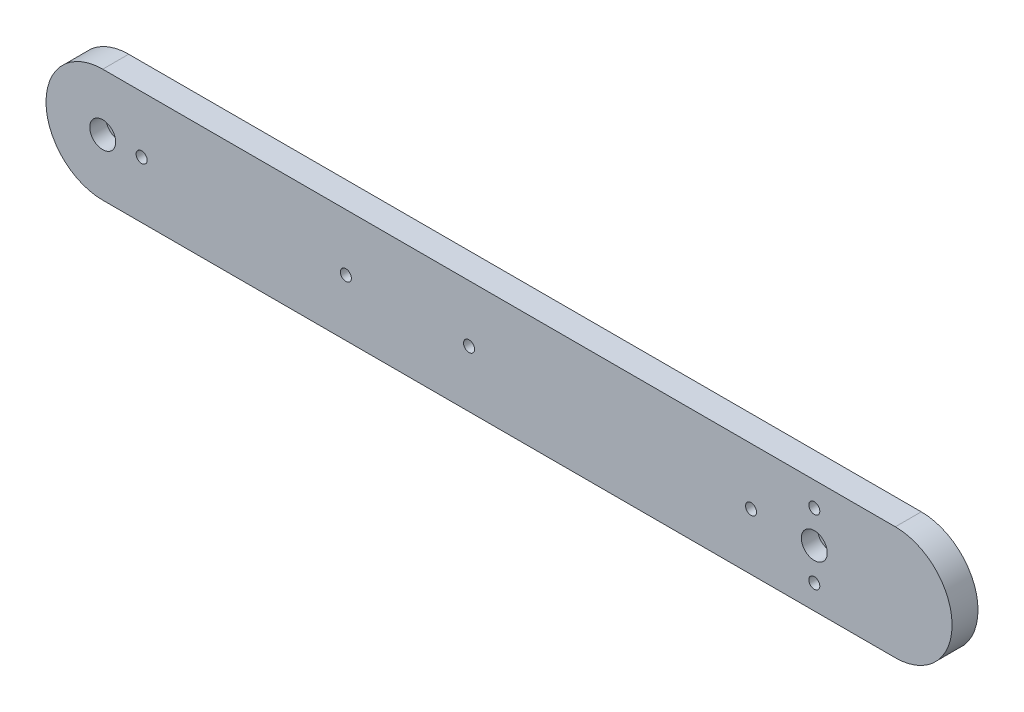
ISO-10303-21;
HEADER;
FILE_DESCRIPTION(('STEP AP214'),'2;1');
FILE_NAME('part.step','',(''),(''),'','','');
FILE_SCHEMA(('AUTOMOTIVE_DESIGN { 1 0 10303 214 1 1 1 1 }'));
ENDSEC;
DATA;
#1=APPLICATION_CONTEXT('core data for automotive mechanical design processes');
#2=APPLICATION_PROTOCOL_DEFINITION('international standard','automotive_design',2000,#1);
#3=PRODUCT_CONTEXT('',#1,'mechanical');
#4=PRODUCT('Part','Part','',(#3));
#5=PRODUCT_RELATED_PRODUCT_CATEGORY('part','',(#4));
#6=PRODUCT_DEFINITION_FORMATION('','',#4);
#7=PRODUCT_DEFINITION_CONTEXT('part definition',#1,'design');
#8=PRODUCT_DEFINITION('design','',#6,#7);
#9=PRODUCT_DEFINITION_SHAPE('','',#8);
#10=(LENGTH_UNIT() NAMED_UNIT(*) SI_UNIT(.MILLI.,.METRE.));
#11=(NAMED_UNIT(*) PLANE_ANGLE_UNIT() SI_UNIT($,.RADIAN.));
#12=(NAMED_UNIT(*) SI_UNIT($,.STERADIAN.) SOLID_ANGLE_UNIT());
#13=UNCERTAINTY_MEASURE_WITH_UNIT(LENGTH_MEASURE(1.E-05),#10,'distance_accuracy_value','');
#14=(GEOMETRIC_REPRESENTATION_CONTEXT(3) GLOBAL_UNCERTAINTY_ASSIGNED_CONTEXT((#13)) GLOBAL_UNIT_ASSIGNED_CONTEXT((#10,
#11,#12)) REPRESENTATION_CONTEXT('',''));
#15=CARTESIAN_POINT('',(0.,0.,0.));
#16=DIRECTION('',(0.,0.,1.));
#17=DIRECTION('',(1.,0.,0.));
#18=AXIS2_PLACEMENT_3D('',#15,#16,#17);
#19=CARTESIAN_POINT('',(0.,35.,4.00000005960464));
#20=DIRECTION('',(0.,1.,0.));
#21=DIRECTION('',(1.,0.,0.));
#22=AXIS2_PLACEMENT_3D('',#19,#20,#21);
#23=PLANE('',#22);
#24=DIRECTION('',(0.,0.,1.));
#25=VECTOR('',#24,1.);
#26=CARTESIAN_POINT('',(-109.750003814697,35.,0.));
#27=LINE('',#26,#25);
#28=CARTESIAN_POINT('',(-109.750003814697,35.,0.));
#29=VERTEX_POINT('',#28);
#30=CARTESIAN_POINT('',(-109.750003814697,35.,8.00000011920929));
#31=VERTEX_POINT('',#30);
#32=EDGE_CURVE('E54',#29,#31,#27,.T.);
#33=ORIENTED_EDGE('',*,*,#32,.T.);
#34=DIRECTION('',(1.,0.,0.));
#35=VECTOR('',#34,1.);
#36=CARTESIAN_POINT('',(-6.89071037865788E-09,35.,8.00000011920929));
#37=LINE('',#36,#35);
#38=CARTESIAN_POINT('',(134.750003814697,35.,8.00000011920929));
#39=VERTEX_POINT('',#38);
#40=EDGE_CURVE('E136',#31,#39,#37,.T.);
#41=ORIENTED_EDGE('',*,*,#40,.T.);
#42=DIRECTION('',(0.,0.,-1.));
#43=VECTOR('',#42,1.);
#44=CARTESIAN_POINT('',(134.750003814697,35.,63.0567889830724));
#45=LINE('',#44,#43);
#46=CARTESIAN_POINT('',(134.750003814697,35.,0.));
#47=VERTEX_POINT('',#46);
#48=EDGE_CURVE('E240',#39,#47,#45,.T.);
#49=ORIENTED_EDGE('',*,*,#48,.T.);
#50=DIRECTION('',(-1.,0.,0.));
#51=VECTOR('',#50,1.);
#52=CARTESIAN_POINT('',(-6.62273830837674E-08,35.,0.));
#53=LINE('',#52,#51);
#54=EDGE_CURVE('E60',#47,#29,#53,.T.);
#55=ORIENTED_EDGE('',*,*,#54,.T.);
#56=EDGE_LOOP('',(#33,#41,#49,#55));
#57=FACE_BOUND('',#56,.T.);
#58=ADVANCED_FACE('F50',(#57),#23,.T.);
#59=CARTESIAN_POINT('',(0.,0.,4.00000005960464));
#60=DIRECTION('',(0.,1.,0.));
#61=DIRECTION('',(1.,0.,0.));
#62=AXIS2_PLACEMENT_3D('',#59,#60,#61);
#63=PLANE('',#62);
#64=DIRECTION('',(1.,0.,0.));
#65=VECTOR('',#64,1.);
#66=CARTESIAN_POINT('',(-6.62273830837674E-08,0.,0.));
#67=LINE('',#66,#65);
#68=CARTESIAN_POINT('',(-109.750003814697,0.,0.));
#69=VERTEX_POINT('',#68);
#70=CARTESIAN_POINT('',(134.750003814697,0.,0.));
#71=VERTEX_POINT('',#70);
#72=EDGE_CURVE('E11',#69,#71,#67,.T.);
#73=ORIENTED_EDGE('',*,*,#72,.T.);
#74=DIRECTION('',(0.,0.,-1.));
#75=VECTOR('',#74,1.);
#76=CARTESIAN_POINT('',(134.750003814697,0.,63.0567889830724));
#77=LINE('',#76,#75);
#78=CARTESIAN_POINT('',(134.750003814697,0.,8.00000011920929));
#79=VERTEX_POINT('',#78);
#80=EDGE_CURVE('E231',#79,#71,#77,.T.);
#81=ORIENTED_EDGE('',*,*,#80,.F.);
#82=DIRECTION('',(-1.,0.,0.));
#83=VECTOR('',#82,1.);
#84=CARTESIAN_POINT('',(-6.89071037865788E-09,0.,8.00000011920929));
#85=LINE('',#84,#83);
#86=CARTESIAN_POINT('',(-109.750003814697,0.,8.00000011920929));
#87=VERTEX_POINT('',#86);
#88=EDGE_CURVE('E156',#79,#87,#85,.T.);
#89=ORIENTED_EDGE('',*,*,#88,.T.);
#90=DIRECTION('',(0.,0.,-1.));
#91=VECTOR('',#90,1.);
#92=CARTESIAN_POINT('',(-109.750003814697,0.,0.));
#93=LINE('',#92,#91);
#94=EDGE_CURVE('E140',#87,#69,#93,.T.);
#95=ORIENTED_EDGE('',*,*,#94,.T.);
#96=EDGE_LOOP('',(#73,#81,#89,#95));
#97=FACE_BOUND('',#96,.T.);
#98=ADVANCED_FACE('F232',(#97),#63,.F.);
#99=CARTESIAN_POINT('',(-1.32454766167535E-07,17.5000002266865,0.));
#100=DIRECTION('',(0.,0.,1.));
#101=DIRECTION('',(1.,0.,0.));
#102=AXIS2_PLACEMENT_3D('',#99,#100,#101);
#103=PLANE('',#102);
#104=CARTESIAN_POINT('',(109.750001212742,27.5000003452395,0.));
#105=DIRECTION('',(0.,0.,-1.));
#106=DIRECTION('',(-1.,0.,0.));
#107=AXIS2_PLACEMENT_3D('',#104,#105,#106);
#108=CIRCLE('',#107,4.00000000000001);
#109=CARTESIAN_POINT('',(105.750001212742,27.5000003452395,0.));
#110=VERTEX_POINT('',#109);
#111=EDGE_CURVE('E296',#110,#110,#108,.T.);
#112=ORIENTED_EDGE('',*,*,#111,.F.);
#113=EDGE_LOOP('',(#112));
#114=FACE_BOUND('',#113,.T.);
#115=CARTESIAN_POINT('',(109.750001212742,7.5000003452395,0.));
#116=DIRECTION('',(0.,0.,-1.));
#117=DIRECTION('',(1.,0.,0.));
#118=AXIS2_PLACEMENT_3D('',#115,#116,#117);
#119=CIRCLE('',#118,4.00000000000001);
#120=CARTESIAN_POINT('',(113.750001212742,7.5000003452395,0.));
#121=VERTEX_POINT('',#120);
#122=EDGE_CURVE('E301',#121,#121,#119,.T.);
#123=ORIENTED_EDGE('',*,*,#122,.F.);
#124=EDGE_LOOP('',(#123));
#125=FACE_BOUND('',#124,.T.);
#126=CARTESIAN_POINT('',(90.2499984818617,17.5,0.));
#127=DIRECTION('',(0.,0.,-1.));
#128=DIRECTION('',(-1.,0.,0.));
#129=AXIS2_PLACEMENT_3D('',#126,#127,#128);
#130=CIRCLE('',#129,4.00000000000001);
#131=CARTESIAN_POINT('',(86.2499984818617,17.5,0.));
#132=VERTEX_POINT('',#131);
#133=EDGE_CURVE('E262',#132,#132,#130,.T.);
#134=ORIENTED_EDGE('',*,*,#133,.F.);
#135=EDGE_LOOP('',(#134));
#136=FACE_BOUND('',#135,.T.);
#137=CARTESIAN_POINT('',(3.24999848186169,17.5,0.));
#138=DIRECTION('',(0.,0.,-1.));
#139=DIRECTION('',(-1.,0.,0.));
#140=AXIS2_PLACEMENT_3D('',#137,#138,#139);
#141=CIRCLE('',#140,4.);
#142=CARTESIAN_POINT('',(-0.750001518138306,17.5,0.));
#143=VERTEX_POINT('',#142);
#144=EDGE_CURVE('E265',#143,#143,#141,.T.);
#145=ORIENTED_EDGE('',*,*,#144,.F.);
#146=EDGE_LOOP('',(#145));
#147=FACE_BOUND('',#146,.T.);
#148=CARTESIAN_POINT('',(109.750001212742,17.5000003452395,0.));
#149=DIRECTION('',(0.,0.,1.));
#150=DIRECTION('',(-1.,0.,0.));
#151=AXIS2_PLACEMENT_3D('',#148,#149,#150);
#152=CIRCLE('',#151,1.70000088262025);
#153=CARTESIAN_POINT('',(111.450002095363,17.5000003452395,0.));
#154=VERTEX_POINT('',#153);
#155=EDGE_CURVE('E155',#154,#154,#152,.T.);
#156=ORIENTED_EDGE('',*,*,#155,.T.);
#157=EDGE_LOOP('',(#156));
#158=FACE_BOUND('',#157,.T.);
#159=CARTESIAN_POINT('',(-109.750002847488,17.5000003452395,-1.37445610448594E-12));
#160=DIRECTION('',(0.,0.,1.));
#161=DIRECTION('',(-1.,0.,0.));
#162=AXIS2_PLACEMENT_3D('',#159,#160,#161);
#163=CIRCLE('',#162,1.69999945421585);
#164=CARTESIAN_POINT('',(-108.050003393272,17.5000003452395,-1.35391697853038E-12));
#165=VERTEX_POINT('',#164);
#166=EDGE_CURVE('E159',#165,#165,#163,.T.);
#167=ORIENTED_EDGE('',*,*,#166,.T.);
#168=EDGE_LOOP('',(#167));
#169=FACE_BOUND('',#168,.T.);
#170=CARTESIAN_POINT('',(-34.7500015181383,17.5,0.));
#171=DIRECTION('',(0.,0.,1.));
#172=DIRECTION('',(1.,0.,0.));
#173=AXIS2_PLACEMENT_3D('',#170,#171,#172);
#174=CIRCLE('',#173,4.);
#175=CARTESIAN_POINT('',(-38.7500015181383,17.5,0.));
#176=VERTEX_POINT('',#175);
#177=EDGE_CURVE('E130',#176,#176,#174,.T.);
#178=ORIENTED_EDGE('',*,*,#177,.T.);
#179=EDGE_LOOP('',(#178));
#180=FACE_BOUND('',#179,.T.);
#181=CARTESIAN_POINT('',(-97.7500015181383,17.5,0.));
#182=DIRECTION('',(0.,0.,1.));
#183=DIRECTION('',(1.,0.,0.));
#184=AXIS2_PLACEMENT_3D('',#181,#182,#183);
#185=CIRCLE('',#184,4.);
#186=CARTESIAN_POINT('',(-101.750001518138,17.5,0.));
#187=VERTEX_POINT('',#186);
#188=EDGE_CURVE('E145',#187,#187,#185,.T.);
#189=ORIENTED_EDGE('',*,*,#188,.T.);
#190=EDGE_LOOP('',(#189));
#191=FACE_BOUND('',#190,.T.);
#192=ORIENTED_EDGE('',*,*,#54,.F.);
#193=CARTESIAN_POINT('',(134.750003814697,17.5,0.));
#194=DIRECTION('',(0.,0.,-1.));
#195=DIRECTION('',(-1.,0.,0.));
#196=AXIS2_PLACEMENT_3D('',#193,#194,#195);
#197=CIRCLE('',#196,17.5);
#198=EDGE_CURVE('E242',#47,#71,#197,.T.);
#199=ORIENTED_EDGE('',*,*,#198,.T.);
#200=ORIENTED_EDGE('',*,*,#72,.F.);
#201=CARTESIAN_POINT('',(-109.750003814697,17.5,0.));
#202=DIRECTION('',(0.,0.,-1.));
#203=DIRECTION('',(0.,1.,0.));
#204=AXIS2_PLACEMENT_3D('',#201,#202,#203);
#205=CIRCLE('',#204,17.5);
#206=EDGE_CURVE('E158',#69,#29,#205,.T.);
#207=ORIENTED_EDGE('',*,*,#206,.T.);
#208=EDGE_LOOP('',(#192,#199,#200,#207));
#209=FACE_BOUND('',#208,.T.);
#210=ADVANCED_FACE('F210',(#114,#125,#136,#147,#158,#169,#180,#191,#209),#103,.F.);
#211=CARTESIAN_POINT('',(-1.37814207573158E-08,17.5000002363904,8.00000011920929));
#212=DIRECTION('',(0.,0.,1.));
#213=DIRECTION('',(1.,0.,0.));
#214=AXIS2_PLACEMENT_3D('',#211,#212,#213);
#215=PLANE('',#214);
#216=CARTESIAN_POINT('',(109.750001212742,27.5000003452395,8.00000011920929));
#217=DIRECTION('',(0.,0.,-1.));
#218=DIRECTION('',(-1.,0.,0.));
#219=AXIS2_PLACEMENT_3D('',#216,#217,#218);
#220=CIRCLE('',#219,1.7);
#221=CARTESIAN_POINT('',(108.050001212742,27.5000003452395,8.00000011920929));
#222=VERTEX_POINT('',#221);
#223=EDGE_CURVE('E317',#222,#222,#220,.T.);
#224=ORIENTED_EDGE('',*,*,#223,.T.);
#225=EDGE_LOOP('',(#224));
#226=FACE_BOUND('',#225,.T.);
#227=CARTESIAN_POINT('',(109.750001212742,7.5000003452395,8.00000011920929));
#228=DIRECTION('',(0.,0.,-1.));
#229=DIRECTION('',(-1.,0.,0.));
#230=AXIS2_PLACEMENT_3D('',#227,#228,#229);
#231=CIRCLE('',#230,1.7);
#232=CARTESIAN_POINT('',(108.050001212742,7.5000003452395,8.00000011920929));
#233=VERTEX_POINT('',#232);
#234=EDGE_CURVE('E321',#233,#233,#231,.T.);
#235=ORIENTED_EDGE('',*,*,#234,.T.);
#236=EDGE_LOOP('',(#235));
#237=FACE_BOUND('',#236,.T.);
#238=CARTESIAN_POINT('',(90.2499984818617,17.5,8.00000011920929));
#239=DIRECTION('',(0.,0.,-1.));
#240=DIRECTION('',(-1.,0.,0.));
#241=AXIS2_PLACEMENT_3D('',#238,#239,#240);
#242=CIRCLE('',#241,1.7);
#243=CARTESIAN_POINT('',(88.5499984818617,17.5,8.00000011920929));
#244=VERTEX_POINT('',#243);
#245=EDGE_CURVE('E247',#244,#244,#242,.T.);
#246=ORIENTED_EDGE('',*,*,#245,.T.);
#247=EDGE_LOOP('',(#246));
#248=FACE_BOUND('',#247,.T.);
#249=CARTESIAN_POINT('',(3.24999848186169,17.5,8.00000011920929));
#250=DIRECTION('',(0.,0.,-1.));
#251=DIRECTION('',(-1.,0.,0.));
#252=AXIS2_PLACEMENT_3D('',#249,#250,#251);
#253=CIRCLE('',#252,1.7);
#254=CARTESIAN_POINT('',(1.54999848186169,17.5,8.00000011920929));
#255=VERTEX_POINT('',#254);
#256=EDGE_CURVE('E237',#255,#255,#253,.T.);
#257=ORIENTED_EDGE('',*,*,#256,.T.);
#258=EDGE_LOOP('',(#257));
#259=FACE_BOUND('',#258,.T.);
#260=CARTESIAN_POINT('',(109.750001685195,17.5000003453171,8.00000011920922));
#261=DIRECTION('',(0.,0.,-1.));
#262=DIRECTION('',(1.,0.,0.));
#263=AXIS2_PLACEMENT_3D('',#260,#261,#262);
#264=CIRCLE('',#263,3.99999970796028);
#265=CARTESIAN_POINT('',(105.750001977235,17.5000003453171,8.00000011920923));
#266=VERTEX_POINT('',#265);
#267=EDGE_CURVE('E120',#266,#266,#264,.T.);
#268=ORIENTED_EDGE('',*,*,#267,.T.);
#269=EDGE_LOOP('',(#268));
#270=FACE_BOUND('',#269,.T.);
#271=CARTESIAN_POINT('',(-109.750001518138,17.500000345317,8.00000011920903));
#272=DIRECTION('',(0.,0.,-1.));
#273=DIRECTION('',(1.,0.,0.));
#274=AXIS2_PLACEMENT_3D('',#271,#272,#273);
#275=CIRCLE('',#274,4.00000049849267);
#276=CARTESIAN_POINT('',(-113.750002016631,17.500000345317,8.00000011920904));
#277=VERTEX_POINT('',#276);
#278=EDGE_CURVE('E146',#277,#277,#275,.T.);
#279=ORIENTED_EDGE('',*,*,#278,.T.);
#280=EDGE_LOOP('',(#279));
#281=FACE_BOUND('',#280,.T.);
#282=CARTESIAN_POINT('',(-34.7500015181383,17.5,8.00000011920929));
#283=DIRECTION('',(0.,0.,-1.));
#284=DIRECTION('',(-1.,0.,0.));
#285=AXIS2_PLACEMENT_3D('',#282,#283,#284);
#286=CIRCLE('',#285,1.7);
#287=CARTESIAN_POINT('',(-33.0500015181383,17.5,8.00000011920929));
#288=VERTEX_POINT('',#287);
#289=EDGE_CURVE('E119',#288,#288,#286,.T.);
#290=ORIENTED_EDGE('',*,*,#289,.T.);
#291=EDGE_LOOP('',(#290));
#292=FACE_BOUND('',#291,.T.);
#293=CARTESIAN_POINT('',(-97.7500015181383,17.5,8.00000011920929));
#294=DIRECTION('',(0.,0.,-1.));
#295=DIRECTION('',(-1.,0.,0.));
#296=AXIS2_PLACEMENT_3D('',#293,#294,#295);
#297=CIRCLE('',#296,1.7);
#298=CARTESIAN_POINT('',(-96.0500015181383,17.5,8.00000011920929));
#299=VERTEX_POINT('',#298);
#300=EDGE_CURVE('E175',#299,#299,#297,.T.);
#301=ORIENTED_EDGE('',*,*,#300,.T.);
#302=EDGE_LOOP('',(#301));
#303=FACE_BOUND('',#302,.T.);
#304=ORIENTED_EDGE('',*,*,#88,.F.);
#305=CARTESIAN_POINT('',(134.750003814697,17.5,8.00000011920929));
#306=DIRECTION('',(0.,0.,1.));
#307=DIRECTION('',(1.,0.,0.));
#308=AXIS2_PLACEMENT_3D('',#305,#306,#307);
#309=CIRCLE('',#308,17.5);
#310=EDGE_CURVE('E224',#39,#79,#309,.F.);
#311=ORIENTED_EDGE('',*,*,#310,.F.);
#312=ORIENTED_EDGE('',*,*,#40,.F.);
#313=CARTESIAN_POINT('',(-109.750003814697,17.5,8.0000001192093));
#314=DIRECTION('',(0.,0.,1.));
#315=DIRECTION('',(0.,1.,0.));
#316=AXIS2_PLACEMENT_3D('',#313,#314,#315);
#317=CIRCLE('',#316,17.5);
#318=EDGE_CURVE('E137',#31,#87,#317,.T.);
#319=ORIENTED_EDGE('',*,*,#318,.T.);
#320=EDGE_LOOP('',(#304,#311,#312,#319));
#321=FACE_BOUND('',#320,.T.);
#322=ADVANCED_FACE('F206',(#226,#237,#248,#259,#270,#281,#292,#303,#321),#215,.T.);
#323=CARTESIAN_POINT('',(-109.750002347506,17.5000003094857,3.00000011920929));
#324=DIRECTION('',(0.,0.,1.));
#325=DIRECTION('',(1.,0.,0.));
#326=AXIS2_PLACEMENT_3D('',#323,#324,#325);
#327=PLANE('',#326);
#328=CARTESIAN_POINT('',(-109.750002847488,17.5000003452395,3.00000011920929));
#329=DIRECTION('',(0.,0.,-1.));
#330=DIRECTION('',(-1.,0.,0.));
#331=AXIS2_PLACEMENT_3D('',#328,#329,#330);
#332=CIRCLE('',#331,1.69999945421585);
#333=CARTESIAN_POINT('',(-108.050003393272,17.5000003452395,3.00000011920931));
#334=VERTEX_POINT('',#333);
#335=EDGE_CURVE('E170',#334,#334,#332,.T.);
#336=ORIENTED_EDGE('',*,*,#335,.T.);
#337=EDGE_LOOP('',(#336));
#338=FACE_BOUND('',#337,.T.);
#339=CARTESIAN_POINT('',(-109.750001518138,17.500000345317,3.00000011920929));
#340=DIRECTION('',(0.,0.,1.));
#341=DIRECTION('',(1.,0.,0.));
#342=AXIS2_PLACEMENT_3D('',#339,#340,#341);
#343=CIRCLE('',#342,4.00000049849267);
#344=CARTESIAN_POINT('',(-113.750002016631,17.500000345317,3.00000011920927));
#345=VERTEX_POINT('',#344);
#346=EDGE_CURVE('E153',#345,#345,#343,.T.);
#347=ORIENTED_EDGE('',*,*,#346,.T.);
#348=EDGE_LOOP('',(#347));
#349=FACE_BOUND('',#348,.T.);
#350=ADVANCED_FACE('F209',(#338,#349),#327,.T.);
#351=CARTESIAN_POINT('',(109.750001430511,17.5000003094857,3.00000011920929));
#352=DIRECTION('',(0.,0.,1.));
#353=DIRECTION('',(1.,0.,0.));
#354=AXIS2_PLACEMENT_3D('',#351,#352,#353);
#355=PLANE('',#354);
#356=CARTESIAN_POINT('',(109.750001212742,17.5000003452395,3.00000011920929));
#357=DIRECTION('',(0.,0.,-1.));
#358=DIRECTION('',(-1.,0.,0.));
#359=AXIS2_PLACEMENT_3D('',#356,#357,#358);
#360=CIRCLE('',#359,1.70000088262025);
#361=CARTESIAN_POINT('',(111.450002095363,17.5000003452395,3.00000011920929));
#362=VERTEX_POINT('',#361);
#363=EDGE_CURVE('E163',#362,#362,#360,.T.);
#364=ORIENTED_EDGE('',*,*,#363,.T.);
#365=EDGE_LOOP('',(#364));
#366=FACE_BOUND('',#365,.T.);
#367=CARTESIAN_POINT('',(109.750001685195,17.5000003453171,3.00000011920929));
#368=DIRECTION('',(0.,0.,1.));
#369=DIRECTION('',(1.,0.,0.));
#370=AXIS2_PLACEMENT_3D('',#367,#368,#369);
#371=CIRCLE('',#370,3.99999970796028);
#372=CARTESIAN_POINT('',(105.750001977235,17.5000003453171,3.00000011920929));
#373=VERTEX_POINT('',#372);
#374=EDGE_CURVE('E150',#373,#373,#371,.T.);
#375=ORIENTED_EDGE('',*,*,#374,.T.);
#376=EDGE_LOOP('',(#375));
#377=FACE_BOUND('',#376,.T.);
#378=ADVANCED_FACE('F52',(#366,#377),#355,.T.);
#379=CARTESIAN_POINT('',(-109.750003814697,17.5,0.));
#380=DIRECTION('',(0.,0.,-1.));
#381=DIRECTION('',(0.,1.,0.));
#382=AXIS2_PLACEMENT_3D('',#379,#380,#381);
#383=CYLINDRICAL_SURFACE('',#382,17.5);
#384=ORIENTED_EDGE('',*,*,#94,.F.);
#385=ORIENTED_EDGE('',*,*,#318,.F.);
#386=ORIENTED_EDGE('',*,*,#32,.F.);
#387=ORIENTED_EDGE('',*,*,#206,.F.);
#388=EDGE_LOOP('',(#384,#385,#386,#387));
#389=FACE_BOUND('',#388,.T.);
#390=ADVANCED_FACE('F361',(#389),#383,.T.);
#391=CARTESIAN_POINT('',(-109.750002847488,17.5000003452395,3.00000011920929));
#392=DIRECTION('',(0.,0.,1.));
#393=DIRECTION('',(-1.,0.,0.));
#394=AXIS2_PLACEMENT_3D('',#391,#392,#393);
#395=CYLINDRICAL_SURFACE('',#394,1.69999945421585);
#396=ORIENTED_EDGE('',*,*,#166,.F.);
#397=DIRECTION('',(0.,0.,1.));
#398=VECTOR('',#397,1.);
#399=CARTESIAN_POINT('',(-108.050003393272,17.5000003452395,3.00000011920931));
#400=LINE('',#399,#398);
#401=EDGE_CURVE('E162',#165,#334,#400,.T.);
#402=ORIENTED_EDGE('',*,*,#401,.T.);
#403=ORIENTED_EDGE('',*,*,#335,.F.);
#404=ORIENTED_EDGE('',*,*,#401,.F.);
#405=EDGE_LOOP('',(#396,#402,#403,#404));
#406=FACE_BOUND('',#405,.T.);
#407=ADVANCED_FACE('F364',(#406),#395,.F.);
#408=CARTESIAN_POINT('',(109.750001212742,17.5000003452395,3.00000011920929));
#409=DIRECTION('',(0.,0.,1.));
#410=DIRECTION('',(-1.,0.,0.));
#411=AXIS2_PLACEMENT_3D('',#408,#409,#410);
#412=CYLINDRICAL_SURFACE('',#411,1.70000088262025);
#413=ORIENTED_EDGE('',*,*,#155,.F.);
#414=DIRECTION('',(0.,0.,1.));
#415=VECTOR('',#414,1.);
#416=CARTESIAN_POINT('',(111.450002095363,17.5000003452395,3.00000011920929));
#417=LINE('',#416,#415);
#418=EDGE_CURVE('E173',#154,#362,#417,.T.);
#419=ORIENTED_EDGE('',*,*,#418,.T.);
#420=ORIENTED_EDGE('',*,*,#363,.F.);
#421=ORIENTED_EDGE('',*,*,#418,.F.);
#422=EDGE_LOOP('',(#413,#419,#420,#421));
#423=FACE_BOUND('',#422,.T.);
#424=ADVANCED_FACE('F368',(#423),#412,.F.);
#425=CARTESIAN_POINT('',(-109.750001518138,17.500000345317,8.00000011920929));
#426=DIRECTION('',(0.,0.,-1.));
#427=DIRECTION('',(1.,0.,0.));
#428=AXIS2_PLACEMENT_3D('',#425,#426,#427);
#429=CYLINDRICAL_SURFACE('',#428,4.00000049849267);
#430=ORIENTED_EDGE('',*,*,#278,.F.);
#431=DIRECTION('',(0.,0.,-1.));
#432=VECTOR('',#431,1.);
#433=CARTESIAN_POINT('',(-113.750002016631,17.500000345317,8.00000011920928));
#434=LINE('',#433,#432);
#435=EDGE_CURVE('E149',#277,#345,#434,.T.);
#436=ORIENTED_EDGE('',*,*,#435,.T.);
#437=ORIENTED_EDGE('',*,*,#346,.F.);
#438=ORIENTED_EDGE('',*,*,#435,.F.);
#439=EDGE_LOOP('',(#430,#436,#437,#438));
#440=FACE_BOUND('',#439,.T.);
#441=ADVANCED_FACE('F350',(#440),#429,.F.);
#442=CARTESIAN_POINT('',(109.750001685195,17.5000003453171,8.00000011920929));
#443=DIRECTION('',(0.,0.,-1.));
#444=DIRECTION('',(1.,0.,0.));
#445=AXIS2_PLACEMENT_3D('',#442,#443,#444);
#446=CYLINDRICAL_SURFACE('',#445,3.99999970796028);
#447=ORIENTED_EDGE('',*,*,#267,.F.);
#448=DIRECTION('',(0.,0.,-1.));
#449=VECTOR('',#448,1.);
#450=CARTESIAN_POINT('',(105.750001977235,17.5000003453171,8.00000011920929));
#451=LINE('',#450,#449);
#452=EDGE_CURVE('E123',#266,#373,#451,.T.);
#453=ORIENTED_EDGE('',*,*,#452,.T.);
#454=ORIENTED_EDGE('',*,*,#374,.F.);
#455=ORIENTED_EDGE('',*,*,#452,.F.);
#456=EDGE_LOOP('',(#447,#453,#454,#455));
#457=FACE_BOUND('',#456,.T.);
#458=ADVANCED_FACE('F204',(#457),#446,.F.);
#459=CARTESIAN_POINT('',(-34.7500015181383,17.5,8.00000011920929));
#460=DIRECTION('',(0.,0.,-1.));
#461=DIRECTION('',(-1.,0.,0.));
#462=AXIS2_PLACEMENT_3D('',#459,#460,#461);
#463=CYLINDRICAL_SURFACE('',#462,1.7);
#464=ORIENTED_EDGE('',*,*,#289,.F.);
#465=DIRECTION('',(0.,0.,-1.));
#466=VECTOR('',#465,1.);
#467=CARTESIAN_POINT('',(-33.0500015181383,17.5,8.00000011920929));
#468=LINE('',#467,#466);
#469=CARTESIAN_POINT('',(-33.0500015181383,17.5,4.));
#470=VERTEX_POINT('',#469);
#471=EDGE_CURVE('E114',#288,#470,#468,.T.);
#472=ORIENTED_EDGE('',*,*,#471,.T.);
#473=CARTESIAN_POINT('',(-34.7500015181383,17.5,4.));
#474=DIRECTION('',(0.,0.,-1.));
#475=DIRECTION('',(-1.,0.,0.));
#476=AXIS2_PLACEMENT_3D('',#473,#474,#475);
#477=CIRCLE('',#476,1.7);
#478=EDGE_CURVE('E117',#470,#470,#477,.T.);
#479=ORIENTED_EDGE('',*,*,#478,.T.);
#480=ORIENTED_EDGE('',*,*,#471,.F.);
#481=EDGE_LOOP('',(#464,#472,#479,#480));
#482=FACE_BOUND('',#481,.T.);
#483=ADVANCED_FACE('F115',(#482),#463,.F.);
#484=CARTESIAN_POINT('',(-97.7500015181383,17.5,8.00000011920929));
#485=DIRECTION('',(0.,0.,-1.));
#486=DIRECTION('',(-1.,0.,0.));
#487=AXIS2_PLACEMENT_3D('',#484,#485,#486);
#488=CYLINDRICAL_SURFACE('',#487,1.7);
#489=ORIENTED_EDGE('',*,*,#300,.F.);
#490=DIRECTION('',(0.,0.,-1.));
#491=VECTOR('',#490,1.);
#492=CARTESIAN_POINT('',(-96.0500015181383,17.5,8.00000011920929));
#493=LINE('',#492,#491);
#494=CARTESIAN_POINT('',(-96.0500015181383,17.5,4.));
#495=VERTEX_POINT('',#494);
#496=EDGE_CURVE('E125',#299,#495,#493,.T.);
#497=ORIENTED_EDGE('',*,*,#496,.T.);
#498=CARTESIAN_POINT('',(-97.7500015181383,17.5,4.));
#499=DIRECTION('',(0.,0.,-1.));
#500=DIRECTION('',(-1.,0.,0.));
#501=AXIS2_PLACEMENT_3D('',#498,#499,#500);
#502=CIRCLE('',#501,1.7);
#503=EDGE_CURVE('E133',#495,#495,#502,.T.);
#504=ORIENTED_EDGE('',*,*,#503,.T.);
#505=ORIENTED_EDGE('',*,*,#496,.F.);
#506=EDGE_LOOP('',(#489,#497,#504,#505));
#507=FACE_BOUND('',#506,.T.);
#508=ADVANCED_FACE('F359',(#507),#488,.F.);
#509=CARTESIAN_POINT('',(-34.7500015181383,17.5,4.));
#510=DIRECTION('',(0.,0.,-1.));
#511=DIRECTION('',(0.,-1.,0.));
#512=AXIS2_PLACEMENT_3D('',#509,#510,#511);
#513=PLANE('',#512);
#514=ORIENTED_EDGE('',*,*,#478,.F.);
#515=EDGE_LOOP('',(#514));
#516=FACE_BOUND('',#515,.T.);
#517=CARTESIAN_POINT('',(-34.7500015181383,17.5,4.));
#518=DIRECTION('',(0.,0.,1.));
#519=DIRECTION('',(1.,0.,0.));
#520=AXIS2_PLACEMENT_3D('',#517,#518,#519);
#521=CIRCLE('',#520,4.);
#522=CARTESIAN_POINT('',(-38.7500015181383,17.5,4.));
#523=VERTEX_POINT('',#522);
#524=EDGE_CURVE('E129',#523,#523,#521,.T.);
#525=ORIENTED_EDGE('',*,*,#524,.F.);
#526=EDGE_LOOP('',(#525));
#527=FACE_BOUND('',#526,.T.);
#528=ADVANCED_FACE('F355',(#516,#527),#513,.T.);
#529=CARTESIAN_POINT('',(-34.7500015181383,17.5,0.));
#530=DIRECTION('',(0.,0.,1.));
#531=DIRECTION('',(1.,0.,0.));
#532=AXIS2_PLACEMENT_3D('',#529,#530,#531);
#533=CYLINDRICAL_SURFACE('',#532,4.);
#534=ORIENTED_EDGE('',*,*,#177,.F.);
#535=DIRECTION('',(0.,0.,1.));
#536=VECTOR('',#535,1.);
#537=CARTESIAN_POINT('',(-38.7500015181383,17.5,0.));
#538=LINE('',#537,#536);
#539=EDGE_CURVE('E132',#176,#523,#538,.T.);
#540=ORIENTED_EDGE('',*,*,#539,.T.);
#541=ORIENTED_EDGE('',*,*,#524,.T.);
#542=ORIENTED_EDGE('',*,*,#539,.F.);
#543=EDGE_LOOP('',(#534,#540,#541,#542));
#544=FACE_BOUND('',#543,.T.);
#545=ADVANCED_FACE('F358',(#544),#533,.F.);
#546=CARTESIAN_POINT('',(-97.7500015181383,17.5,4.));
#547=DIRECTION('',(0.,0.,-1.));
#548=DIRECTION('',(0.,-1.,0.));
#549=AXIS2_PLACEMENT_3D('',#546,#547,#548);
#550=PLANE('',#549);
#551=ORIENTED_EDGE('',*,*,#503,.F.);
#552=EDGE_LOOP('',(#551));
#553=FACE_BOUND('',#552,.T.);
#554=CARTESIAN_POINT('',(-97.7500015181383,17.5,4.));
#555=DIRECTION('',(0.,0.,1.));
#556=DIRECTION('',(1.,0.,0.));
#557=AXIS2_PLACEMENT_3D('',#554,#555,#556);
#558=CIRCLE('',#557,4.);
#559=CARTESIAN_POINT('',(-101.750001518138,17.5,4.));
#560=VERTEX_POINT('',#559);
#561=EDGE_CURVE('E144',#560,#560,#558,.T.);
#562=ORIENTED_EDGE('',*,*,#561,.F.);
#563=EDGE_LOOP('',(#562));
#564=FACE_BOUND('',#563,.T.);
#565=ADVANCED_FACE('F353',(#553,#564),#550,.T.);
#566=CARTESIAN_POINT('',(-97.7500015181383,17.5,0.));
#567=DIRECTION('',(0.,0.,1.));
#568=DIRECTION('',(1.,0.,0.));
#569=AXIS2_PLACEMENT_3D('',#566,#567,#568);
#570=CYLINDRICAL_SURFACE('',#569,4.);
#571=ORIENTED_EDGE('',*,*,#188,.F.);
#572=DIRECTION('',(0.,0.,1.));
#573=VECTOR('',#572,1.);
#574=CARTESIAN_POINT('',(-101.750001518138,17.5,0.));
#575=LINE('',#574,#573);
#576=EDGE_CURVE('E141',#187,#560,#575,.T.);
#577=ORIENTED_EDGE('',*,*,#576,.T.);
#578=ORIENTED_EDGE('',*,*,#561,.T.);
#579=ORIENTED_EDGE('',*,*,#576,.F.);
#580=EDGE_LOOP('',(#571,#577,#578,#579));
#581=FACE_BOUND('',#580,.T.);
#582=ADVANCED_FACE('F275',(#581),#570,.F.);
#583=CARTESIAN_POINT('',(3.24999848186169,17.5,4.));
#584=DIRECTION('',(0.,0.,-1.));
#585=DIRECTION('',(-1.,0.,0.));
#586=AXIS2_PLACEMENT_3D('',#583,#584,#585);
#587=CYLINDRICAL_SURFACE('',#586,4.);
#588=CARTESIAN_POINT('',(3.24999848186169,17.5,4.));
#589=DIRECTION('',(0.,0.,-1.));
#590=DIRECTION('',(-1.,0.,0.));
#591=AXIS2_PLACEMENT_3D('',#588,#589,#590);
#592=CIRCLE('',#591,4.);
#593=CARTESIAN_POINT('',(-0.750001518138306,17.5,4.));
#594=VERTEX_POINT('',#593);
#595=EDGE_CURVE('E258',#594,#594,#592,.T.);
#596=ORIENTED_EDGE('',*,*,#595,.F.);
#597=EDGE_LOOP('',(#596));
#598=FACE_BOUND('',#597,.T.);
#599=ORIENTED_EDGE('',*,*,#144,.T.);
#600=EDGE_LOOP('',(#599));
#601=FACE_BOUND('',#600,.T.);
#602=ADVANCED_FACE('F272',(#598,#601),#587,.F.);
#603=CARTESIAN_POINT('',(3.24999848186169,17.5,4.));
#604=DIRECTION('',(0.,0.,-1.));
#605=DIRECTION('',(-1.,0.,0.));
#606=AXIS2_PLACEMENT_3D('',#603,#604,#605);
#607=PLANE('',#606);
#608=CARTESIAN_POINT('',(3.24999848186169,17.5,4.));
#609=DIRECTION('',(0.,0.,-1.));
#610=DIRECTION('',(-1.,0.,0.));
#611=AXIS2_PLACEMENT_3D('',#608,#609,#610);
#612=CIRCLE('',#611,1.7);
#613=CARTESIAN_POINT('',(1.54999848186169,17.5,4.));
#614=VERTEX_POINT('',#613);
#615=EDGE_CURVE('E255',#614,#614,#612,.T.);
#616=ORIENTED_EDGE('',*,*,#615,.F.);
#617=EDGE_LOOP('',(#616));
#618=FACE_BOUND('',#617,.T.);
#619=ORIENTED_EDGE('',*,*,#595,.T.);
#620=EDGE_LOOP('',(#619));
#621=FACE_BOUND('',#620,.T.);
#622=ADVANCED_FACE('F270',(#618,#621),#607,.T.);
#623=CARTESIAN_POINT('',(90.2499984818617,17.5,4.));
#624=DIRECTION('',(0.,0.,-1.));
#625=DIRECTION('',(-1.,0.,0.));
#626=AXIS2_PLACEMENT_3D('',#623,#624,#625);
#627=CYLINDRICAL_SURFACE('',#626,4.00000000000001);
#628=CARTESIAN_POINT('',(90.2499984818617,17.5,4.));
#629=DIRECTION('',(0.,0.,-1.));
#630=DIRECTION('',(-1.,0.,0.));
#631=AXIS2_PLACEMENT_3D('',#628,#629,#630);
#632=CIRCLE('',#631,4.00000000000001);
#633=CARTESIAN_POINT('',(86.2499984818617,17.5,4.));
#634=VERTEX_POINT('',#633);
#635=EDGE_CURVE('E259',#634,#634,#632,.T.);
#636=ORIENTED_EDGE('',*,*,#635,.F.);
#637=EDGE_LOOP('',(#636));
#638=FACE_BOUND('',#637,.T.);
#639=ORIENTED_EDGE('',*,*,#133,.T.);
#640=EDGE_LOOP('',(#639));
#641=FACE_BOUND('',#640,.T.);
#642=ADVANCED_FACE('F447',(#638,#641),#627,.F.);
#643=CARTESIAN_POINT('',(90.2499984818617,17.5,4.));
#644=DIRECTION('',(0.,0.,-1.));
#645=DIRECTION('',(-1.,0.,0.));
#646=AXIS2_PLACEMENT_3D('',#643,#644,#645);
#647=PLANE('',#646);
#648=CARTESIAN_POINT('',(90.2499984818617,17.5,4.));
#649=DIRECTION('',(0.,0.,-1.));
#650=DIRECTION('',(-1.,0.,0.));
#651=AXIS2_PLACEMENT_3D('',#648,#649,#650);
#652=CIRCLE('',#651,1.7);
#653=CARTESIAN_POINT('',(88.5499984818617,17.5,4.));
#654=VERTEX_POINT('',#653);
#655=EDGE_CURVE('E250',#654,#654,#652,.T.);
#656=ORIENTED_EDGE('',*,*,#655,.F.);
#657=EDGE_LOOP('',(#656));
#658=FACE_BOUND('',#657,.T.);
#659=ORIENTED_EDGE('',*,*,#635,.T.);
#660=EDGE_LOOP('',(#659));
#661=FACE_BOUND('',#660,.T.);
#662=ADVANCED_FACE('F455',(#658,#661),#647,.T.);
#663=CARTESIAN_POINT('',(90.2499984818617,17.5,8.00000011920929));
#664=DIRECTION('',(0.,0.,-1.));
#665=DIRECTION('',(-1.,0.,0.));
#666=AXIS2_PLACEMENT_3D('',#663,#664,#665);
#667=CYLINDRICAL_SURFACE('',#666,1.7);
#668=ORIENTED_EDGE('',*,*,#655,.T.);
#669=EDGE_LOOP('',(#668));
#670=FACE_BOUND('',#669,.T.);
#671=ORIENTED_EDGE('',*,*,#245,.F.);
#672=EDGE_LOOP('',(#671));
#673=FACE_BOUND('',#672,.T.);
#674=ADVANCED_FACE('F463',(#670,#673),#667,.F.);
#675=CARTESIAN_POINT('',(3.24999848186169,17.5,8.00000011920929));
#676=DIRECTION('',(0.,0.,-1.));
#677=DIRECTION('',(-1.,0.,0.));
#678=AXIS2_PLACEMENT_3D('',#675,#676,#677);
#679=CYLINDRICAL_SURFACE('',#678,1.7);
#680=ORIENTED_EDGE('',*,*,#615,.T.);
#681=EDGE_LOOP('',(#680));
#682=FACE_BOUND('',#681,.T.);
#683=ORIENTED_EDGE('',*,*,#256,.F.);
#684=EDGE_LOOP('',(#683));
#685=FACE_BOUND('',#684,.T.);
#686=ADVANCED_FACE('F471',(#682,#685),#679,.F.);
#687=CARTESIAN_POINT('',(134.750003814697,17.5,63.0567889830724));
#688=DIRECTION('',(0.,0.,-1.));
#689=DIRECTION('',(-1.,0.,0.));
#690=AXIS2_PLACEMENT_3D('',#687,#688,#689);
#691=CYLINDRICAL_SURFACE('',#690,17.5);
#692=ORIENTED_EDGE('',*,*,#48,.F.);
#693=ORIENTED_EDGE('',*,*,#310,.T.);
#694=ORIENTED_EDGE('',*,*,#80,.T.);
#695=ORIENTED_EDGE('',*,*,#198,.F.);
#696=EDGE_LOOP('',(#692,#693,#694,#695));
#697=FACE_BOUND('',#696,.T.);
#698=ADVANCED_FACE('F239',(#697),#691,.T.);
#699=CARTESIAN_POINT('',(109.750001212742,7.5000003452395,4.));
#700=DIRECTION('',(0.,0.,-1.));
#701=DIRECTION('',(-1.,0.,0.));
#702=AXIS2_PLACEMENT_3D('',#699,#700,#701);
#703=CYLINDRICAL_SURFACE('',#702,4.00000000000001);
#704=CARTESIAN_POINT('',(109.750001212742,7.5000003452395,4.));
#705=DIRECTION('',(0.,0.,-1.));
#706=DIRECTION('',(1.,0.,0.));
#707=AXIS2_PLACEMENT_3D('',#704,#705,#706);
#708=CIRCLE('',#707,4.00000000000001);
#709=CARTESIAN_POINT('',(113.750001212742,7.5000003452395,4.));
#710=VERTEX_POINT('',#709);
#711=EDGE_CURVE('E308',#710,#710,#708,.T.);
#712=ORIENTED_EDGE('',*,*,#711,.F.);
#713=EDGE_LOOP('',(#712));
#714=FACE_BOUND('',#713,.T.);
#715=ORIENTED_EDGE('',*,*,#122,.T.);
#716=EDGE_LOOP('',(#715));
#717=FACE_BOUND('',#716,.T.);
#718=ADVANCED_FACE('F486',(#714,#717),#703,.F.);
#719=CARTESIAN_POINT('',(109.750001212742,7.5000003452395,4.));
#720=DIRECTION('',(0.,0.,1.));
#721=DIRECTION('',(1.,0.,0.));
#722=AXIS2_PLACEMENT_3D('',#719,#720,#721);
#723=PLANE('',#722);
#724=CARTESIAN_POINT('',(109.750001212742,7.5000003452395,4.));
#725=DIRECTION('',(0.,0.,1.));
#726=DIRECTION('',(1.,0.,0.));
#727=AXIS2_PLACEMENT_3D('',#724,#725,#726);
#728=CIRCLE('',#727,1.7);
#729=CARTESIAN_POINT('',(111.450001212742,7.5000003452395,4.));
#730=VERTEX_POINT('',#729);
#731=EDGE_CURVE('E304',#730,#730,#728,.T.);
#732=ORIENTED_EDGE('',*,*,#731,.T.);
#733=EDGE_LOOP('',(#732));
#734=FACE_BOUND('',#733,.T.);
#735=ORIENTED_EDGE('',*,*,#711,.T.);
#736=EDGE_LOOP('',(#735));
#737=FACE_BOUND('',#736,.T.);
#738=ADVANCED_FACE('F495',(#734,#737),#723,.F.);
#739=CARTESIAN_POINT('',(109.750001212742,27.5000003452395,4.));
#740=DIRECTION('',(0.,0.,-1.));
#741=DIRECTION('',(-1.,0.,0.));
#742=AXIS2_PLACEMENT_3D('',#739,#740,#741);
#743=CYLINDRICAL_SURFACE('',#742,4.00000000000001);
#744=CARTESIAN_POINT('',(109.750001212742,27.5000003452395,4.));
#745=DIRECTION('',(0.,0.,-1.));
#746=DIRECTION('',(-1.,0.,0.));
#747=AXIS2_PLACEMENT_3D('',#744,#745,#746);
#748=CIRCLE('',#747,4.00000000000001);
#749=CARTESIAN_POINT('',(105.750001212742,27.5000003452395,4.));
#750=VERTEX_POINT('',#749);
#751=EDGE_CURVE('E294',#750,#750,#748,.T.);
#752=ORIENTED_EDGE('',*,*,#751,.F.);
#753=EDGE_LOOP('',(#752));
#754=FACE_BOUND('',#753,.T.);
#755=ORIENTED_EDGE('',*,*,#111,.T.);
#756=EDGE_LOOP('',(#755));
#757=FACE_BOUND('',#756,.T.);
#758=ADVANCED_FACE('F503',(#754,#757),#743,.F.);
#759=CARTESIAN_POINT('',(109.750001212742,27.5000003452395,4.));
#760=DIRECTION('',(0.,0.,-1.));
#761=DIRECTION('',(-1.,0.,0.));
#762=AXIS2_PLACEMENT_3D('',#759,#760,#761);
#763=PLANE('',#762);
#764=CARTESIAN_POINT('',(109.750001212742,27.5000003452395,4.));
#765=DIRECTION('',(0.,0.,-1.));
#766=DIRECTION('',(-1.,0.,0.));
#767=AXIS2_PLACEMENT_3D('',#764,#765,#766);
#768=CIRCLE('',#767,1.7);
#769=CARTESIAN_POINT('',(108.050001212742,27.5000003452395,4.));
#770=VERTEX_POINT('',#769);
#771=EDGE_CURVE('E313',#770,#770,#768,.T.);
#772=ORIENTED_EDGE('',*,*,#771,.F.);
#773=EDGE_LOOP('',(#772));
#774=FACE_BOUND('',#773,.T.);
#775=ORIENTED_EDGE('',*,*,#751,.T.);
#776=EDGE_LOOP('',(#775));
#777=FACE_BOUND('',#776,.T.);
#778=ADVANCED_FACE('F337',(#774,#777),#763,.T.);
#779=CARTESIAN_POINT('',(109.750001212742,27.5000003452395,8.00000011920929));
#780=DIRECTION('',(0.,0.,-1.));
#781=DIRECTION('',(-1.,0.,0.));
#782=AXIS2_PLACEMENT_3D('',#779,#780,#781);
#783=CYLINDRICAL_SURFACE('',#782,1.7);
#784=ORIENTED_EDGE('',*,*,#771,.T.);
#785=EDGE_LOOP('',(#784));
#786=FACE_BOUND('',#785,.T.);
#787=ORIENTED_EDGE('',*,*,#223,.F.);
#788=EDGE_LOOP('',(#787));
#789=FACE_BOUND('',#788,.T.);
#790=ADVANCED_FACE('F332',(#786,#789),#783,.F.);
#791=CARTESIAN_POINT('',(109.750001212742,7.5000003452395,8.00000011920929));
#792=DIRECTION('',(0.,0.,-1.));
#793=DIRECTION('',(-1.,0.,0.));
#794=AXIS2_PLACEMENT_3D('',#791,#792,#793);
#795=CYLINDRICAL_SURFACE('',#794,1.7);
#796=ORIENTED_EDGE('',*,*,#234,.F.);
#797=EDGE_LOOP('',(#796));
#798=FACE_BOUND('',#797,.T.);
#799=ORIENTED_EDGE('',*,*,#731,.F.);
#800=EDGE_LOOP('',(#799));
#801=FACE_BOUND('',#800,.T.);
#802=ADVANCED_FACE('F329',(#798,#801),#795,.F.);
#803=CLOSED_SHELL('',(#58,#98,#210,#322,#350,#378,#390,#407,#424,#441,#458,#483,#508,#528,#545,
#565,#582,#602,#622,#642,#662,#674,#686,#698,#718,#738,#758,#778,#790,#802));
#804=MANIFOLD_SOLID_BREP('B2',#803);
#805=ADVANCED_BREP_SHAPE_REPRESENTATION('',(#18,#804),#14);
#806=SHAPE_DEFINITION_REPRESENTATION(#9,#805);
ENDSEC;
END-ISO-10303-21;
